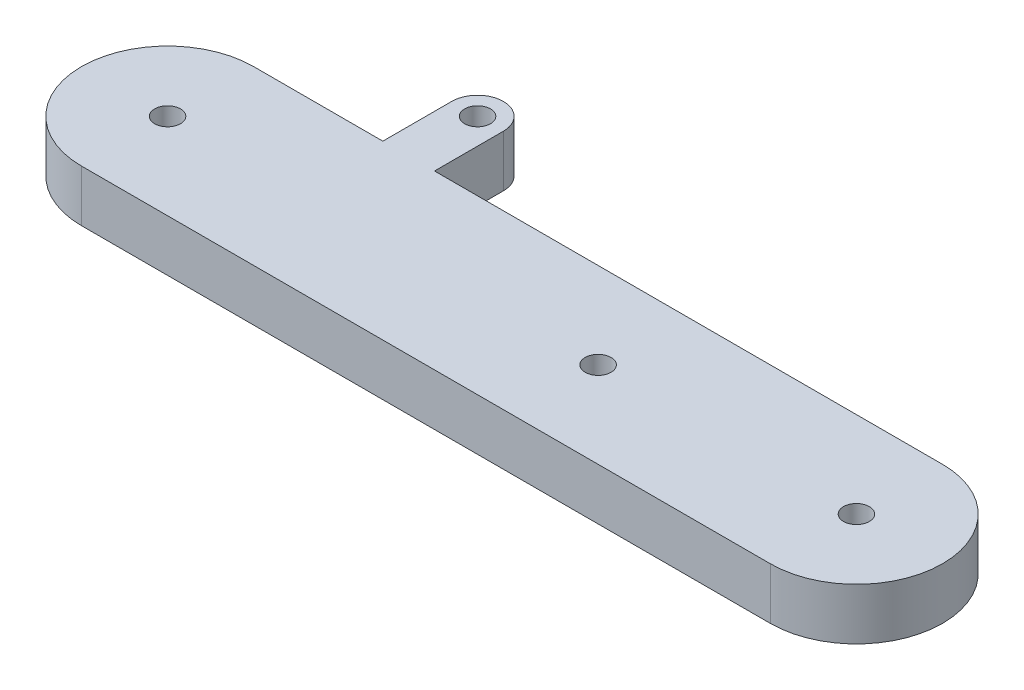
ISO-10303-21;
HEADER;
FILE_DESCRIPTION(('STEP AP214'),'2;1');
FILE_NAME('part.step','',(''),(''),'','','');
FILE_SCHEMA(('AUTOMOTIVE_DESIGN { 1 0 10303 214 1 1 1 1 }'));
ENDSEC;
DATA;
#1=APPLICATION_CONTEXT('core data for automotive mechanical design processes');
#2=APPLICATION_PROTOCOL_DEFINITION('international standard','automotive_design',2000,#1);
#3=PRODUCT_CONTEXT('',#1,'mechanical');
#4=PRODUCT('Part','Part','',(#3));
#5=PRODUCT_RELATED_PRODUCT_CATEGORY('part','',(#4));
#6=PRODUCT_DEFINITION_FORMATION('','',#4);
#7=PRODUCT_DEFINITION_CONTEXT('part definition',#1,'design');
#8=PRODUCT_DEFINITION('design','',#6,#7);
#9=PRODUCT_DEFINITION_SHAPE('','',#8);
#10=(LENGTH_UNIT() NAMED_UNIT(*) SI_UNIT(.MILLI.,.METRE.));
#11=(NAMED_UNIT(*) PLANE_ANGLE_UNIT() SI_UNIT($,.RADIAN.));
#12=(NAMED_UNIT(*) SI_UNIT($,.STERADIAN.) SOLID_ANGLE_UNIT());
#13=UNCERTAINTY_MEASURE_WITH_UNIT(LENGTH_MEASURE(1.E-05),#10,'distance_accuracy_value','');
#14=(GEOMETRIC_REPRESENTATION_CONTEXT(3) GLOBAL_UNCERTAINTY_ASSIGNED_CONTEXT((#13)) GLOBAL_UNIT_ASSIGNED_CONTEXT((#10,
#11,#12)) REPRESENTATION_CONTEXT('',''));
#15=CARTESIAN_POINT('',(0.,0.,0.));
#16=DIRECTION('',(0.,0.,1.));
#17=DIRECTION('',(1.,0.,0.));
#18=AXIS2_PLACEMENT_3D('',#15,#16,#17);
#19=CARTESIAN_POINT('',(0.,6.,-9.99999999999999));
#20=DIRECTION('',(0.,-1.,0.));
#21=DIRECTION('',(0.,0.,-1.));
#22=AXIS2_PLACEMENT_3D('',#19,#20,#21);
#23=PLANE('',#22);
#24=CARTESIAN_POINT('',(0.,6.,-9.99999999999999));
#25=DIRECTION('',(0.,1.,0.));
#26=DIRECTION('',(0.,0.,-1.));
#27=AXIS2_PLACEMENT_3D('',#24,#25,#26);
#28=CIRCLE('',#27,10.);
#29=CARTESIAN_POINT('',(0.,6.,0.));
#30=VERTEX_POINT('',#29);
#31=CARTESIAN_POINT('',(0.,6.,-20.));
#32=VERTEX_POINT('',#31);
#33=EDGE_CURVE('E166',#30,#32,#28,.T.);
#34=ORIENTED_EDGE('',*,*,#33,.T.);
#35=DIRECTION('',(-1.,0.,0.));
#36=VECTOR('',#35,1.);
#37=CARTESIAN_POINT('',(0.,6.,-20.));
#38=LINE('',#37,#36);
#39=CARTESIAN_POINT('',(-59.,6.,-20.));
#40=VERTEX_POINT('',#39);
#41=EDGE_CURVE('E102',#32,#40,#38,.T.);
#42=ORIENTED_EDGE('',*,*,#41,.T.);
#43=DIRECTION('',(0.,0.,-1.));
#44=VECTOR('',#43,1.);
#45=CARTESIAN_POINT('',(-59.,6.,-20.));
#46=LINE('',#45,#44);
#47=CARTESIAN_POINT('',(-59.,6.,-28.));
#48=VERTEX_POINT('',#47);
#49=EDGE_CURVE('E187',#40,#48,#46,.T.);
#50=ORIENTED_EDGE('',*,*,#49,.T.);
#51=CARTESIAN_POINT('',(-62.,6.,-27.9999999999999));
#52=DIRECTION('',(0.,1.,0.));
#53=DIRECTION('',(0.,0.,1.));
#54=AXIS2_PLACEMENT_3D('',#51,#52,#53);
#55=CIRCLE('',#54,3.);
#56=CARTESIAN_POINT('',(-65.,6.,-27.9999999999999));
#57=VERTEX_POINT('',#56);
#58=EDGE_CURVE('E201',#48,#57,#55,.T.);
#59=ORIENTED_EDGE('',*,*,#58,.T.);
#60=DIRECTION('',(0.,0.,1.));
#61=VECTOR('',#60,1.);
#62=CARTESIAN_POINT('',(-65.,6.,-20.));
#63=LINE('',#62,#61);
#64=CARTESIAN_POINT('',(-65.,6.,-20.));
#65=VERTEX_POINT('',#64);
#66=EDGE_CURVE('E121',#57,#65,#63,.T.);
#67=ORIENTED_EDGE('',*,*,#66,.T.);
#68=DIRECTION('',(-1.,0.,0.));
#69=VECTOR('',#68,1.);
#70=CARTESIAN_POINT('',(-65.,6.,-20.));
#71=LINE('',#70,#69);
#72=CARTESIAN_POINT('',(-80.,6.,-20.));
#73=VERTEX_POINT('',#72);
#74=EDGE_CURVE('E115',#65,#73,#71,.T.);
#75=ORIENTED_EDGE('',*,*,#74,.T.);
#76=CARTESIAN_POINT('',(-80.,6.,-9.99999999999999));
#77=DIRECTION('',(0.,1.,0.));
#78=DIRECTION('',(0.,0.,1.));
#79=AXIS2_PLACEMENT_3D('',#76,#77,#78);
#80=CIRCLE('',#79,10.);
#81=CARTESIAN_POINT('',(-80.,6.,0.));
#82=VERTEX_POINT('',#81);
#83=EDGE_CURVE('E119',#73,#82,#80,.T.);
#84=ORIENTED_EDGE('',*,*,#83,.T.);
#85=DIRECTION('',(1.,0.,0.));
#86=VECTOR('',#85,1.);
#87=CARTESIAN_POINT('',(0.,6.,0.));
#88=LINE('',#87,#86);
#89=EDGE_CURVE('E59',#82,#30,#88,.T.);
#90=ORIENTED_EDGE('',*,*,#89,.T.);
#91=EDGE_LOOP('',(#34,#42,#50,#59,#67,#75,#84,#90));
#92=FACE_BOUND('',#91,.T.);
#93=CARTESIAN_POINT('',(-80.,6.,-9.99999999999999));
#94=DIRECTION('',(0.,1.,0.));
#95=DIRECTION('',(0.,0.,1.));
#96=AXIS2_PLACEMENT_3D('',#93,#94,#95);
#97=CIRCLE('',#96,1.5);
#98=CARTESIAN_POINT('',(-80.,6.,-8.49999999999999));
#99=VERTEX_POINT('',#98);
#100=EDGE_CURVE('E148',#99,#99,#97,.T.);
#101=ORIENTED_EDGE('',*,*,#100,.F.);
#102=EDGE_LOOP('',(#101));
#103=FACE_BOUND('',#102,.T.);
#104=CARTESIAN_POINT('',(0.,6.,-9.99999999999999));
#105=DIRECTION('',(0.,1.,0.));
#106=DIRECTION('',(0.,0.,-1.));
#107=AXIS2_PLACEMENT_3D('',#104,#105,#106);
#108=CIRCLE('',#107,1.5);
#109=CARTESIAN_POINT('',(0.,6.,-11.5));
#110=VERTEX_POINT('',#109);
#111=EDGE_CURVE('E215',#110,#110,#108,.T.);
#112=ORIENTED_EDGE('',*,*,#111,.F.);
#113=EDGE_LOOP('',(#112));
#114=FACE_BOUND('',#113,.T.);
#115=CARTESIAN_POINT('',(-30.,6.,-9.99999999999998));
#116=DIRECTION('',(0.,1.,0.));
#117=DIRECTION('',(0.,0.,1.));
#118=AXIS2_PLACEMENT_3D('',#115,#116,#117);
#119=CIRCLE('',#118,1.5);
#120=CARTESIAN_POINT('',(-30.,6.,-8.49999999999998));
#121=VERTEX_POINT('',#120);
#122=EDGE_CURVE('E223',#121,#121,#119,.T.);
#123=ORIENTED_EDGE('',*,*,#122,.F.);
#124=EDGE_LOOP('',(#123));
#125=FACE_BOUND('',#124,.T.);
#126=CARTESIAN_POINT('',(-62.,6.,-27.9999999999999));
#127=DIRECTION('',(0.,1.,0.));
#128=DIRECTION('',(0.,0.,1.));
#129=AXIS2_PLACEMENT_3D('',#126,#127,#128);
#130=CIRCLE('',#129,1.5);
#131=CARTESIAN_POINT('',(-62.,6.,-26.4999999999999));
#132=VERTEX_POINT('',#131);
#133=EDGE_CURVE('E231',#132,#132,#130,.T.);
#134=ORIENTED_EDGE('',*,*,#133,.F.);
#135=EDGE_LOOP('',(#134));
#136=FACE_BOUND('',#135,.T.);
#137=ADVANCED_FACE('F41',(#92,#103,#114,#125,#136),#23,.F.);
#138=CARTESIAN_POINT('',(0.,0.,-9.99999999999999));
#139=DIRECTION('',(0.,-1.,0.));
#140=DIRECTION('',(0.,0.,-1.));
#141=AXIS2_PLACEMENT_3D('',#138,#139,#140);
#142=PLANE('',#141);
#143=CARTESIAN_POINT('',(-30.,0.,-9.99999999999998));
#144=DIRECTION('',(0.,1.,0.));
#145=DIRECTION('',(0.,0.,1.));
#146=AXIS2_PLACEMENT_3D('',#143,#144,#145);
#147=CIRCLE('',#146,1.5);
#148=CARTESIAN_POINT('',(-30.,0.,-8.49999999999998));
#149=VERTEX_POINT('',#148);
#150=EDGE_CURVE('E227',#149,#149,#147,.T.);
#151=ORIENTED_EDGE('',*,*,#150,.T.);
#152=EDGE_LOOP('',(#151));
#153=FACE_BOUND('',#152,.T.);
#154=CARTESIAN_POINT('',(-80.,0.,-9.99999999999999));
#155=DIRECTION('',(0.,1.,0.));
#156=DIRECTION('',(0.,0.,1.));
#157=AXIS2_PLACEMENT_3D('',#154,#155,#156);
#158=CIRCLE('',#157,1.5);
#159=CARTESIAN_POINT('',(-80.,0.,-8.49999999999999));
#160=VERTEX_POINT('',#159);
#161=EDGE_CURVE('E211',#160,#160,#158,.T.);
#162=ORIENTED_EDGE('',*,*,#161,.T.);
#163=EDGE_LOOP('',(#162));
#164=FACE_BOUND('',#163,.T.);
#165=CARTESIAN_POINT('',(0.,0.,-9.99999999999999));
#166=DIRECTION('',(0.,1.,0.));
#167=DIRECTION('',(0.,0.,-1.));
#168=AXIS2_PLACEMENT_3D('',#165,#166,#167);
#169=CIRCLE('',#168,10.);
#170=CARTESIAN_POINT('',(0.,0.,0.));
#171=VERTEX_POINT('',#170);
#172=CARTESIAN_POINT('',(0.,0.,-20.));
#173=VERTEX_POINT('',#172);
#174=EDGE_CURVE('E143',#171,#173,#169,.T.);
#175=ORIENTED_EDGE('',*,*,#174,.F.);
#176=DIRECTION('',(1.,0.,0.));
#177=VECTOR('',#176,1.);
#178=CARTESIAN_POINT('',(0.,0.,0.));
#179=LINE('',#178,#177);
#180=CARTESIAN_POINT('',(-80.,0.,0.));
#181=VERTEX_POINT('',#180);
#182=EDGE_CURVE('E94',#181,#171,#179,.T.);
#183=ORIENTED_EDGE('',*,*,#182,.F.);
#184=CARTESIAN_POINT('',(-80.,0.,-9.99999999999999));
#185=DIRECTION('',(0.,1.,0.));
#186=DIRECTION('',(0.,0.,1.));
#187=AXIS2_PLACEMENT_3D('',#184,#185,#186);
#188=CIRCLE('',#187,10.);
#189=CARTESIAN_POINT('',(-80.,0.,-20.));
#190=VERTEX_POINT('',#189);
#191=EDGE_CURVE('E88',#190,#181,#188,.T.);
#192=ORIENTED_EDGE('',*,*,#191,.F.);
#193=DIRECTION('',(-1.,0.,0.));
#194=VECTOR('',#193,1.);
#195=CARTESIAN_POINT('',(-65.,0.,-20.));
#196=LINE('',#195,#194);
#197=CARTESIAN_POINT('',(-65.,0.,-20.));
#198=VERTEX_POINT('',#197);
#199=EDGE_CURVE('E130',#198,#190,#196,.T.);
#200=ORIENTED_EDGE('',*,*,#199,.F.);
#201=DIRECTION('',(0.,0.,1.));
#202=VECTOR('',#201,1.);
#203=CARTESIAN_POINT('',(-65.,0.,-20.));
#204=LINE('',#203,#202);
#205=CARTESIAN_POINT('',(-65.,0.,-27.9999999999999));
#206=VERTEX_POINT('',#205);
#207=EDGE_CURVE('E157',#206,#198,#204,.T.);
#208=ORIENTED_EDGE('',*,*,#207,.F.);
#209=CARTESIAN_POINT('',(-62.,0.,-27.9999999999999));
#210=DIRECTION('',(0.,1.,0.));
#211=DIRECTION('',(0.,0.,1.));
#212=AXIS2_PLACEMENT_3D('',#209,#210,#211);
#213=CIRCLE('',#212,3.);
#214=CARTESIAN_POINT('',(-59.,0.,-28.));
#215=VERTEX_POINT('',#214);
#216=EDGE_CURVE('E154',#215,#206,#213,.T.);
#217=ORIENTED_EDGE('',*,*,#216,.F.);
#218=DIRECTION('',(0.,0.,-1.));
#219=VECTOR('',#218,1.);
#220=CARTESIAN_POINT('',(-59.,0.,-20.));
#221=LINE('',#220,#219);
#222=CARTESIAN_POINT('',(-59.,0.,-20.));
#223=VERTEX_POINT('',#222);
#224=EDGE_CURVE('E151',#223,#215,#221,.T.);
#225=ORIENTED_EDGE('',*,*,#224,.F.);
#226=DIRECTION('',(-1.,0.,0.));
#227=VECTOR('',#226,1.);
#228=CARTESIAN_POINT('',(0.,0.,-20.));
#229=LINE('',#228,#227);
#230=EDGE_CURVE('E147',#173,#223,#229,.T.);
#231=ORIENTED_EDGE('',*,*,#230,.F.);
#232=EDGE_LOOP('',(#175,#183,#192,#200,#208,#217,#225,#231));
#233=FACE_BOUND('',#232,.T.);
#234=CARTESIAN_POINT('',(0.,0.,-9.99999999999999));
#235=DIRECTION('',(0.,1.,0.));
#236=DIRECTION('',(0.,0.,-1.));
#237=AXIS2_PLACEMENT_3D('',#234,#235,#236);
#238=CIRCLE('',#237,1.5);
#239=CARTESIAN_POINT('',(0.,0.,-11.5));
#240=VERTEX_POINT('',#239);
#241=EDGE_CURVE('E219',#240,#240,#238,.T.);
#242=ORIENTED_EDGE('',*,*,#241,.T.);
#243=EDGE_LOOP('',(#242));
#244=FACE_BOUND('',#243,.T.);
#245=CARTESIAN_POINT('',(-62.,0.,-27.9999999999999));
#246=DIRECTION('',(0.,1.,0.));
#247=DIRECTION('',(0.,0.,1.));
#248=AXIS2_PLACEMENT_3D('',#245,#246,#247);
#249=CIRCLE('',#248,1.5);
#250=CARTESIAN_POINT('',(-62.,0.,-26.4999999999999));
#251=VERTEX_POINT('',#250);
#252=EDGE_CURVE('E235',#251,#251,#249,.T.);
#253=ORIENTED_EDGE('',*,*,#252,.T.);
#254=EDGE_LOOP('',(#253));
#255=FACE_BOUND('',#254,.T.);
#256=ADVANCED_FACE('F191',(#153,#164,#233,#244,#255),#142,.T.);
#257=CARTESIAN_POINT('',(0.,6.,-9.99999999999999));
#258=DIRECTION('',(0.,-1.,0.));
#259=DIRECTION('',(0.,0.,-1.));
#260=AXIS2_PLACEMENT_3D('',#257,#258,#259);
#261=CYLINDRICAL_SURFACE('',#260,10.);
#262=ORIENTED_EDGE('',*,*,#174,.T.);
#263=DIRECTION('',(0.,-1.,0.));
#264=VECTOR('',#263,1.);
#265=CARTESIAN_POINT('',(0.,6.,-20.));
#266=LINE('',#265,#264);
#267=EDGE_CURVE('E11',#32,#173,#266,.T.);
#268=ORIENTED_EDGE('',*,*,#267,.F.);
#269=ORIENTED_EDGE('',*,*,#33,.F.);
#270=DIRECTION('',(0.,-1.,0.));
#271=VECTOR('',#270,1.);
#272=CARTESIAN_POINT('',(0.,6.,0.));
#273=LINE('',#272,#271);
#274=EDGE_CURVE('E139',#30,#171,#273,.T.);
#275=ORIENTED_EDGE('',*,*,#274,.T.);
#276=EDGE_LOOP('',(#262,#268,#269,#275));
#277=FACE_BOUND('',#276,.T.);
#278=ADVANCED_FACE('F43',(#277),#261,.T.);
#279=CARTESIAN_POINT('',(0.,6.,-20.));
#280=DIRECTION('',(0.,0.,1.));
#281=DIRECTION('',(1.,0.,0.));
#282=AXIS2_PLACEMENT_3D('',#279,#280,#281);
#283=PLANE('',#282);
#284=ORIENTED_EDGE('',*,*,#230,.T.);
#285=DIRECTION('',(0.,-1.,0.));
#286=VECTOR('',#285,1.);
#287=CARTESIAN_POINT('',(-59.,6.,-20.));
#288=LINE('',#287,#286);
#289=EDGE_CURVE('E51',#40,#223,#288,.T.);
#290=ORIENTED_EDGE('',*,*,#289,.F.);
#291=ORIENTED_EDGE('',*,*,#41,.F.);
#292=ORIENTED_EDGE('',*,*,#267,.T.);
#293=EDGE_LOOP('',(#284,#290,#291,#292));
#294=FACE_BOUND('',#293,.T.);
#295=ADVANCED_FACE('F269',(#294),#283,.F.);
#296=CARTESIAN_POINT('',(-59.,6.,-20.));
#297=DIRECTION('',(-1.,0.,0.));
#298=DIRECTION('',(0.,0.,1.));
#299=AXIS2_PLACEMENT_3D('',#296,#297,#298);
#300=PLANE('',#299);
#301=ORIENTED_EDGE('',*,*,#224,.T.);
#302=DIRECTION('',(0.,-1.,0.));
#303=VECTOR('',#302,1.);
#304=CARTESIAN_POINT('',(-59.,6.,-28.));
#305=LINE('',#304,#303);
#306=EDGE_CURVE('E177',#48,#215,#305,.T.);
#307=ORIENTED_EDGE('',*,*,#306,.F.);
#308=ORIENTED_EDGE('',*,*,#49,.F.);
#309=ORIENTED_EDGE('',*,*,#289,.T.);
#310=EDGE_LOOP('',(#301,#307,#308,#309));
#311=FACE_BOUND('',#310,.T.);
#312=ADVANCED_FACE('F185',(#311),#300,.F.);
#313=CARTESIAN_POINT('',(-62.,6.,-27.9999999999999));
#314=DIRECTION('',(0.,-1.,0.));
#315=DIRECTION('',(0.,0.,-1.));
#316=AXIS2_PLACEMENT_3D('',#313,#314,#315);
#317=CYLINDRICAL_SURFACE('',#316,3.);
#318=ORIENTED_EDGE('',*,*,#216,.T.);
#319=DIRECTION('',(0.,-1.,0.));
#320=VECTOR('',#319,1.);
#321=CARTESIAN_POINT('',(-65.,6.,-27.9999999999999));
#322=LINE('',#321,#320);
#323=EDGE_CURVE('E173',#57,#206,#322,.T.);
#324=ORIENTED_EDGE('',*,*,#323,.F.);
#325=ORIENTED_EDGE('',*,*,#58,.F.);
#326=ORIENTED_EDGE('',*,*,#306,.T.);
#327=EDGE_LOOP('',(#318,#324,#325,#326));
#328=FACE_BOUND('',#327,.T.);
#329=ADVANCED_FACE('F196',(#328),#317,.T.);
#330=CARTESIAN_POINT('',(-65.,6.,-20.));
#331=DIRECTION('',(1.,0.,0.));
#332=DIRECTION('',(0.,0.,-1.));
#333=AXIS2_PLACEMENT_3D('',#330,#331,#332);
#334=PLANE('',#333);
#335=ORIENTED_EDGE('',*,*,#207,.T.);
#336=DIRECTION('',(0.,-1.,0.));
#337=VECTOR('',#336,1.);
#338=CARTESIAN_POINT('',(-65.,6.,-20.));
#339=LINE('',#338,#337);
#340=EDGE_CURVE('E132',#65,#198,#339,.T.);
#341=ORIENTED_EDGE('',*,*,#340,.F.);
#342=ORIENTED_EDGE('',*,*,#66,.F.);
#343=ORIENTED_EDGE('',*,*,#323,.T.);
#344=EDGE_LOOP('',(#335,#341,#342,#343));
#345=FACE_BOUND('',#344,.T.);
#346=ADVANCED_FACE('F199',(#345),#334,.F.);
#347=CARTESIAN_POINT('',(-65.,6.,-20.));
#348=DIRECTION('',(0.,0.,1.));
#349=DIRECTION('',(1.,0.,0.));
#350=AXIS2_PLACEMENT_3D('',#347,#348,#349);
#351=PLANE('',#350);
#352=ORIENTED_EDGE('',*,*,#199,.T.);
#353=DIRECTION('',(0.,-1.,0.));
#354=VECTOR('',#353,1.);
#355=CARTESIAN_POINT('',(-80.,6.,-20.));
#356=LINE('',#355,#354);
#357=EDGE_CURVE('E127',#73,#190,#356,.T.);
#358=ORIENTED_EDGE('',*,*,#357,.F.);
#359=ORIENTED_EDGE('',*,*,#74,.F.);
#360=ORIENTED_EDGE('',*,*,#340,.T.);
#361=EDGE_LOOP('',(#352,#358,#359,#360));
#362=FACE_BOUND('',#361,.T.);
#363=ADVANCED_FACE('F128',(#362),#351,.F.);
#364=CARTESIAN_POINT('',(-80.,6.,-9.99999999999999));
#365=DIRECTION('',(0.,-1.,0.));
#366=DIRECTION('',(0.,0.,-1.));
#367=AXIS2_PLACEMENT_3D('',#364,#365,#366);
#368=CYLINDRICAL_SURFACE('',#367,10.);
#369=ORIENTED_EDGE('',*,*,#191,.T.);
#370=DIRECTION('',(0.,-1.,0.));
#371=VECTOR('',#370,1.);
#372=CARTESIAN_POINT('',(-80.,6.,0.));
#373=LINE('',#372,#371);
#374=EDGE_CURVE('E133',#82,#181,#373,.T.);
#375=ORIENTED_EDGE('',*,*,#374,.F.);
#376=ORIENTED_EDGE('',*,*,#83,.F.);
#377=ORIENTED_EDGE('',*,*,#357,.T.);
#378=EDGE_LOOP('',(#369,#375,#376,#377));
#379=FACE_BOUND('',#378,.T.);
#380=ADVANCED_FACE('F135',(#379),#368,.T.);
#381=CARTESIAN_POINT('',(0.,6.,0.));
#382=DIRECTION('',(0.,0.,-1.));
#383=DIRECTION('',(-1.,0.,0.));
#384=AXIS2_PLACEMENT_3D('',#381,#382,#383);
#385=PLANE('',#384);
#386=ORIENTED_EDGE('',*,*,#182,.T.);
#387=ORIENTED_EDGE('',*,*,#274,.F.);
#388=ORIENTED_EDGE('',*,*,#89,.F.);
#389=ORIENTED_EDGE('',*,*,#374,.T.);
#390=EDGE_LOOP('',(#386,#387,#388,#389));
#391=FACE_BOUND('',#390,.T.);
#392=ADVANCED_FACE('F257',(#391),#385,.F.);
#393=CARTESIAN_POINT('',(-80.,6.,-9.99999999999999));
#394=DIRECTION('',(0.,-1.,0.));
#395=DIRECTION('',(0.,0.,-1.));
#396=AXIS2_PLACEMENT_3D('',#393,#394,#395);
#397=CYLINDRICAL_SURFACE('',#396,1.5);
#398=ORIENTED_EDGE('',*,*,#100,.T.);
#399=EDGE_LOOP('',(#398));
#400=FACE_BOUND('',#399,.T.);
#401=ORIENTED_EDGE('',*,*,#161,.F.);
#402=EDGE_LOOP('',(#401));
#403=FACE_BOUND('',#402,.T.);
#404=ADVANCED_FACE('F254',(#400,#403),#397,.F.);
#405=CARTESIAN_POINT('',(0.,6.,-9.99999999999999));
#406=DIRECTION('',(0.,-1.,0.));
#407=DIRECTION('',(0.,0.,-1.));
#408=AXIS2_PLACEMENT_3D('',#405,#406,#407);
#409=CYLINDRICAL_SURFACE('',#408,1.5);
#410=ORIENTED_EDGE('',*,*,#111,.T.);
#411=EDGE_LOOP('',(#410));
#412=FACE_BOUND('',#411,.T.);
#413=ORIENTED_EDGE('',*,*,#241,.F.);
#414=EDGE_LOOP('',(#413));
#415=FACE_BOUND('',#414,.T.);
#416=ADVANCED_FACE('F333',(#412,#415),#409,.F.);
#417=CARTESIAN_POINT('',(-30.,6.,-9.99999999999998));
#418=DIRECTION('',(0.,-1.,0.));
#419=DIRECTION('',(0.,0.,-1.));
#420=AXIS2_PLACEMENT_3D('',#417,#418,#419);
#421=CYLINDRICAL_SURFACE('',#420,1.5);
#422=ORIENTED_EDGE('',*,*,#122,.T.);
#423=EDGE_LOOP('',(#422));
#424=FACE_BOUND('',#423,.T.);
#425=ORIENTED_EDGE('',*,*,#150,.F.);
#426=EDGE_LOOP('',(#425));
#427=FACE_BOUND('',#426,.T.);
#428=ADVANCED_FACE('F341',(#424,#427),#421,.F.);
#429=CARTESIAN_POINT('',(-62.,6.,-27.9999999999999));
#430=DIRECTION('',(0.,-1.,0.));
#431=DIRECTION('',(0.,0.,-1.));
#432=AXIS2_PLACEMENT_3D('',#429,#430,#431);
#433=CYLINDRICAL_SURFACE('',#432,1.5);
#434=ORIENTED_EDGE('',*,*,#133,.T.);
#435=EDGE_LOOP('',(#434));
#436=FACE_BOUND('',#435,.T.);
#437=ORIENTED_EDGE('',*,*,#252,.F.);
#438=EDGE_LOOP('',(#437));
#439=FACE_BOUND('',#438,.T.);
#440=ADVANCED_FACE('F243',(#436,#439),#433,.F.);
#441=CLOSED_SHELL('',(#137,#256,#278,#295,#312,#329,#346,#363,#380,#392,#404,#416,#428,#440));
#442=MANIFOLD_SOLID_BREP('B2',#441);
#443=ADVANCED_BREP_SHAPE_REPRESENTATION('',(#18,#442),#14);
#444=SHAPE_DEFINITION_REPRESENTATION(#9,#443);
ENDSEC;
END-ISO-10303-21;
